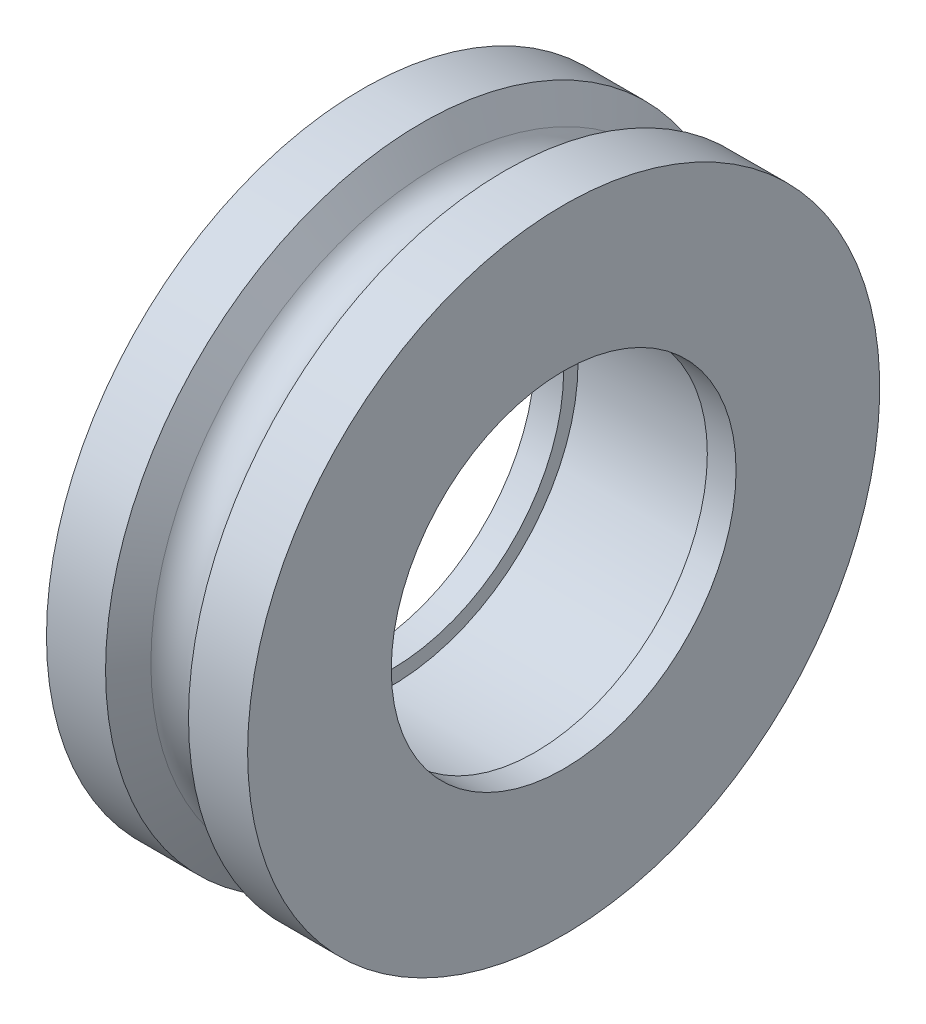
ISO-10303-21;
HEADER;
FILE_DESCRIPTION(('STEP AP214'),'2;1');
FILE_NAME('part.step','',(''),(''),'','','');
FILE_SCHEMA(('AUTOMOTIVE_DESIGN { 1 0 10303 214 1 1 1 1 }'));
ENDSEC;
DATA;
#1=APPLICATION_CONTEXT('core data for automotive mechanical design processes');
#2=APPLICATION_PROTOCOL_DEFINITION('international standard','automotive_design',2000,#1);
#3=PRODUCT_CONTEXT('',#1,'mechanical');
#4=PRODUCT('Part','Part','',(#3));
#5=PRODUCT_RELATED_PRODUCT_CATEGORY('part','',(#4));
#6=PRODUCT_DEFINITION_FORMATION('','',#4);
#7=PRODUCT_DEFINITION_CONTEXT('part definition',#1,'design');
#8=PRODUCT_DEFINITION('design','',#6,#7);
#9=PRODUCT_DEFINITION_SHAPE('','',#8);
#10=(LENGTH_UNIT() NAMED_UNIT(*) SI_UNIT(.MILLI.,.METRE.));
#11=(NAMED_UNIT(*) PLANE_ANGLE_UNIT() SI_UNIT($,.RADIAN.));
#12=(NAMED_UNIT(*) SI_UNIT($,.STERADIAN.) SOLID_ANGLE_UNIT());
#13=UNCERTAINTY_MEASURE_WITH_UNIT(LENGTH_MEASURE(1.E-05),#10,'distance_accuracy_value','');
#14=(GEOMETRIC_REPRESENTATION_CONTEXT(3) GLOBAL_UNCERTAINTY_ASSIGNED_CONTEXT((#13)) GLOBAL_UNIT_ASSIGNED_CONTEXT((#10,
#11,#12)) REPRESENTATION_CONTEXT('',''));
#15=CARTESIAN_POINT('',(0.,0.,0.));
#16=DIRECTION('',(0.,0.,1.));
#17=DIRECTION('',(1.,0.,0.));
#18=AXIS2_PLACEMENT_3D('',#15,#16,#17);
#19=CARTESIAN_POINT('',(3.5,6.,0.));
#20=DIRECTION('',(1.,0.,0.));
#21=DIRECTION('',(0.,0.,-1.));
#22=AXIS2_PLACEMENT_3D('',#19,#20,#21);
#23=PLANE('',#22);
#24=CARTESIAN_POINT('',(3.5,0.,0.));
#25=DIRECTION('',(-1.,0.,0.));
#26=DIRECTION('',(0.,0.,1.));
#27=AXIS2_PLACEMENT_3D('',#24,#25,#26);
#28=CIRCLE('',#27,6.);
#29=CARTESIAN_POINT('',(3.5,0.,6.));
#30=VERTEX_POINT('',#29);
#31=EDGE_CURVE('E17',#30,#30,#28,.T.);
#32=ORIENTED_EDGE('',*,*,#31,.T.);
#33=EDGE_LOOP('',(#32));
#34=FACE_BOUND('',#33,.T.);
#35=CARTESIAN_POINT('',(3.5,0.,0.));
#36=DIRECTION('',(-1.,0.,0.));
#37=DIRECTION('',(0.,0.,1.));
#38=AXIS2_PLACEMENT_3D('',#35,#36,#37);
#39=CIRCLE('',#38,11.);
#40=CARTESIAN_POINT('',(3.5,0.,11.));
#41=VERTEX_POINT('',#40);
#42=EDGE_CURVE('E46',#41,#41,#39,.T.);
#43=ORIENTED_EDGE('',*,*,#42,.F.);
#44=EDGE_LOOP('',(#43));
#45=FACE_BOUND('',#44,.T.);
#46=ADVANCED_FACE('F14',(#34,#45),#23,.T.);
#47=CARTESIAN_POINT('',(3.5,0.,0.));
#48=DIRECTION('',(-1.,0.,0.));
#49=DIRECTION('',(0.,0.,1.));
#50=AXIS2_PLACEMENT_3D('',#47,#48,#49);
#51=CYLINDRICAL_SURFACE('',#50,6.);
#52=CARTESIAN_POINT('',(2.5,0.,0.));
#53=DIRECTION('',(-1.,0.,0.));
#54=DIRECTION('',(0.,0.,1.));
#55=AXIS2_PLACEMENT_3D('',#52,#53,#54);
#56=CIRCLE('',#55,6.);
#57=CARTESIAN_POINT('',(2.5,0.,6.));
#58=VERTEX_POINT('',#57);
#59=EDGE_CURVE('E44',#58,#58,#56,.F.);
#60=ORIENTED_EDGE('',*,*,#59,.F.);
#61=EDGE_LOOP('',(#60));
#62=FACE_BOUND('',#61,.T.);
#63=ORIENTED_EDGE('',*,*,#31,.F.);
#64=EDGE_LOOP('',(#63));
#65=FACE_BOUND('',#64,.T.);
#66=ADVANCED_FACE('F55',(#62,#65),#51,.F.);
#67=CARTESIAN_POINT('',(3.5,0.,0.));
#68=DIRECTION('',(-1.,0.,0.));
#69=DIRECTION('',(0.,0.,1.));
#70=AXIS2_PLACEMENT_3D('',#67,#68,#69);
#71=CYLINDRICAL_SURFACE('',#70,11.);
#72=ORIENTED_EDGE('',*,*,#42,.T.);
#73=EDGE_LOOP('',(#72));
#74=FACE_BOUND('',#73,.T.);
#75=CARTESIAN_POINT('',(1.44337567297407,0.,0.));
#76=DIRECTION('',(1.,0.,0.));
#77=DIRECTION('',(0.,0.,-1.));
#78=AXIS2_PLACEMENT_3D('',#75,#76,#77);
#79=CIRCLE('',#78,11.);
#80=CARTESIAN_POINT('',(1.44337567297407,0.,-11.));
#81=VERTEX_POINT('',#80);
#82=EDGE_CURVE('E43',#81,#81,#79,.F.);
#83=ORIENTED_EDGE('',*,*,#82,.F.);
#84=EDGE_LOOP('',(#83));
#85=FACE_BOUND('',#84,.T.);
#86=ADVANCED_FACE('F57',(#74,#85),#71,.T.);
#87=CARTESIAN_POINT('',(2.5,6.5,0.));
#88=DIRECTION('',(-1.,0.,0.));
#89=DIRECTION('',(0.,0.,1.));
#90=AXIS2_PLACEMENT_3D('',#87,#88,#89);
#91=PLANE('',#90);
#92=CARTESIAN_POINT('',(2.5,0.,0.));
#93=DIRECTION('',(-1.,0.,0.));
#94=DIRECTION('',(0.,0.,1.));
#95=AXIS2_PLACEMENT_3D('',#92,#93,#94);
#96=CIRCLE('',#95,6.5);
#97=CARTESIAN_POINT('',(2.5,0.,6.5));
#98=VERTEX_POINT('',#97);
#99=EDGE_CURVE('E40',#98,#98,#96,.T.);
#100=ORIENTED_EDGE('',*,*,#99,.T.);
#101=EDGE_LOOP('',(#100));
#102=FACE_BOUND('',#101,.T.);
#103=ORIENTED_EDGE('',*,*,#59,.T.);
#104=EDGE_LOOP('',(#103));
#105=FACE_BOUND('',#104,.T.);
#106=ADVANCED_FACE('F64',(#102,#105),#91,.T.);
#107=CARTESIAN_POINT('',(1.44337567297407,0.,0.));
#108=DIRECTION('',(1.,0.,0.));
#109=DIRECTION('',(0.,1.,0.));
#110=AXIS2_PLACEMENT_3D('',#107,#108,#109);
#111=CONICAL_SURFACE('',#110,11.,1.0471975511966);
#112=ORIENTED_EDGE('',*,*,#82,.T.);
#113=EDGE_LOOP('',(#112));
#114=FACE_BOUND('',#113,.T.);
#115=CARTESIAN_POINT('',(0.866025403784438,0.,0.));
#116=DIRECTION('',(1.,0.,0.));
#117=DIRECTION('',(0.,0.,-1.));
#118=AXIS2_PLACEMENT_3D('',#115,#116,#117);
#119=CIRCLE('',#118,10.);
#120=CARTESIAN_POINT('',(0.866025403784438,0.,-10.));
#121=VERTEX_POINT('',#120);
#122=EDGE_CURVE('E39',#121,#121,#119,.T.);
#123=ORIENTED_EDGE('',*,*,#122,.T.);
#124=EDGE_LOOP('',(#123));
#125=FACE_BOUND('',#124,.T.);
#126=ADVANCED_FACE('F108',(#114,#125),#111,.T.);
#127=CARTESIAN_POINT('',(3.5,0.,0.));
#128=DIRECTION('',(-1.,0.,0.));
#129=DIRECTION('',(0.,0.,1.));
#130=AXIS2_PLACEMENT_3D('',#127,#128,#129);
#131=CYLINDRICAL_SURFACE('',#130,6.5);
#132=CARTESIAN_POINT('',(-2.5,0.,0.));
#133=DIRECTION('',(-1.,0.,0.));
#134=DIRECTION('',(0.,0.,1.));
#135=AXIS2_PLACEMENT_3D('',#132,#133,#134);
#136=CIRCLE('',#135,6.5);
#137=CARTESIAN_POINT('',(-2.5,0.,6.5));
#138=VERTEX_POINT('',#137);
#139=EDGE_CURVE('E36',#138,#138,#136,.F.);
#140=ORIENTED_EDGE('',*,*,#139,.F.);
#141=EDGE_LOOP('',(#140));
#142=FACE_BOUND('',#141,.T.);
#143=ORIENTED_EDGE('',*,*,#99,.F.);
#144=EDGE_LOOP('',(#143));
#145=FACE_BOUND('',#144,.T.);
#146=ADVANCED_FACE('F94',(#142,#145),#131,.F.);
#147=CARTESIAN_POINT('',(0.,0.,0.));
#148=DIRECTION('',(1.,0.,0.));
#149=DIRECTION('',(0.,0.,-1.));
#150=AXIS2_PLACEMENT_3D('',#147,#148,#149);
#151=TOROIDAL_SURFACE('',#150,10.5,0.999999999999999);
#152=CARTESIAN_POINT('',(-0.866025403784437,0.,0.));
#153=DIRECTION('',(-1.,0.,0.));
#154=DIRECTION('',(0.,0.,1.));
#155=AXIS2_PLACEMENT_3D('',#152,#153,#154);
#156=CIRCLE('',#155,10.);
#157=CARTESIAN_POINT('',(-0.866025403784437,0.,10.));
#158=VERTEX_POINT('',#157);
#159=EDGE_CURVE('E35',#158,#158,#156,.T.);
#160=ORIENTED_EDGE('',*,*,#159,.F.);
#161=EDGE_LOOP('',(#160));
#162=FACE_BOUND('',#161,.T.);
#163=ORIENTED_EDGE('',*,*,#122,.F.);
#164=EDGE_LOOP('',(#163));
#165=FACE_BOUND('',#164,.T.);
#166=ADVANCED_FACE('F89',(#162,#165),#151,.F.);
#167=CARTESIAN_POINT('',(-2.5,6.,0.));
#168=DIRECTION('',(1.,0.,0.));
#169=DIRECTION('',(0.,0.,-1.));
#170=AXIS2_PLACEMENT_3D('',#167,#168,#169);
#171=PLANE('',#170);
#172=CARTESIAN_POINT('',(-2.5,0.,0.));
#173=DIRECTION('',(-1.,0.,0.));
#174=DIRECTION('',(0.,0.,1.));
#175=AXIS2_PLACEMENT_3D('',#172,#173,#174);
#176=CIRCLE('',#175,6.);
#177=CARTESIAN_POINT('',(-2.5,0.,6.));
#178=VERTEX_POINT('',#177);
#179=EDGE_CURVE('E32',#178,#178,#176,.T.);
#180=ORIENTED_EDGE('',*,*,#179,.T.);
#181=EDGE_LOOP('',(#180));
#182=FACE_BOUND('',#181,.T.);
#183=ORIENTED_EDGE('',*,*,#139,.T.);
#184=EDGE_LOOP('',(#183));
#185=FACE_BOUND('',#184,.T.);
#186=ADVANCED_FACE('F85',(#182,#185),#171,.T.);
#187=CARTESIAN_POINT('',(-1.44337567297406,0.,0.));
#188=DIRECTION('',(-1.,0.,0.));
#189=DIRECTION('',(0.,0.,1.));
#190=AXIS2_PLACEMENT_3D('',#187,#188,#189);
#191=CONICAL_SURFACE('',#190,11.,1.0471975511966);
#192=ORIENTED_EDGE('',*,*,#159,.T.);
#193=EDGE_LOOP('',(#192));
#194=FACE_BOUND('',#193,.T.);
#195=CARTESIAN_POINT('',(-1.44337567297406,0.,0.));
#196=DIRECTION('',(-1.,0.,0.));
#197=DIRECTION('',(0.,0.,1.));
#198=AXIS2_PLACEMENT_3D('',#195,#196,#197);
#199=CIRCLE('',#198,11.);
#200=CARTESIAN_POINT('',(-1.44337567297406,0.,11.));
#201=VERTEX_POINT('',#200);
#202=EDGE_CURVE('E26',#201,#201,#199,.T.);
#203=ORIENTED_EDGE('',*,*,#202,.F.);
#204=EDGE_LOOP('',(#203));
#205=FACE_BOUND('',#204,.T.);
#206=ADVANCED_FACE('F81',(#194,#205),#191,.T.);
#207=CARTESIAN_POINT('',(3.5,0.,0.));
#208=DIRECTION('',(-1.,0.,0.));
#209=DIRECTION('',(0.,0.,1.));
#210=AXIS2_PLACEMENT_3D('',#207,#208,#209);
#211=CYLINDRICAL_SURFACE('',#210,6.);
#212=CARTESIAN_POINT('',(-3.5,0.,0.));
#213=DIRECTION('',(-1.,0.,0.));
#214=DIRECTION('',(0.,0.,1.));
#215=AXIS2_PLACEMENT_3D('',#212,#213,#214);
#216=CIRCLE('',#215,6.);
#217=CARTESIAN_POINT('',(-3.5,0.,6.));
#218=VERTEX_POINT('',#217);
#219=EDGE_CURVE('E21',#218,#218,#216,.F.);
#220=ORIENTED_EDGE('',*,*,#219,.F.);
#221=EDGE_LOOP('',(#220));
#222=FACE_BOUND('',#221,.T.);
#223=ORIENTED_EDGE('',*,*,#179,.F.);
#224=EDGE_LOOP('',(#223));
#225=FACE_BOUND('',#224,.T.);
#226=ADVANCED_FACE('F74',(#222,#225),#211,.F.);
#227=CARTESIAN_POINT('',(3.5,0.,0.));
#228=DIRECTION('',(-1.,0.,0.));
#229=DIRECTION('',(0.,0.,1.));
#230=AXIS2_PLACEMENT_3D('',#227,#228,#229);
#231=CYLINDRICAL_SURFACE('',#230,11.);
#232=ORIENTED_EDGE('',*,*,#202,.T.);
#233=EDGE_LOOP('',(#232));
#234=FACE_BOUND('',#233,.T.);
#235=CARTESIAN_POINT('',(-3.5,0.,0.));
#236=DIRECTION('',(-1.,0.,0.));
#237=DIRECTION('',(0.,0.,1.));
#238=AXIS2_PLACEMENT_3D('',#235,#236,#237);
#239=CIRCLE('',#238,11.);
#240=CARTESIAN_POINT('',(-3.5,0.,11.));
#241=VERTEX_POINT('',#240);
#242=EDGE_CURVE('E10',#241,#241,#239,.T.);
#243=ORIENTED_EDGE('',*,*,#242,.F.);
#244=EDGE_LOOP('',(#243));
#245=FACE_BOUND('',#244,.T.);
#246=ADVANCED_FACE('F69',(#234,#245),#231,.T.);
#247=CARTESIAN_POINT('',(-3.5,11.,0.));
#248=DIRECTION('',(-1.,0.,0.));
#249=DIRECTION('',(0.,0.,1.));
#250=AXIS2_PLACEMENT_3D('',#247,#248,#249);
#251=PLANE('',#250);
#252=ORIENTED_EDGE('',*,*,#242,.T.);
#253=EDGE_LOOP('',(#252));
#254=FACE_BOUND('',#253,.T.);
#255=ORIENTED_EDGE('',*,*,#219,.T.);
#256=EDGE_LOOP('',(#255));
#257=FACE_BOUND('',#256,.T.);
#258=ADVANCED_FACE('F67',(#254,#257),#251,.T.);
#259=CLOSED_SHELL('',(#46,#66,#86,#106,#126,#146,#166,#186,#206,#226,#246,#258));
#260=MANIFOLD_SOLID_BREP('B1',#259);
#261=ADVANCED_BREP_SHAPE_REPRESENTATION('',(#18,#260),#14);
#262=SHAPE_DEFINITION_REPRESENTATION(#9,#261);
ENDSEC;
END-ISO-10303-21;
